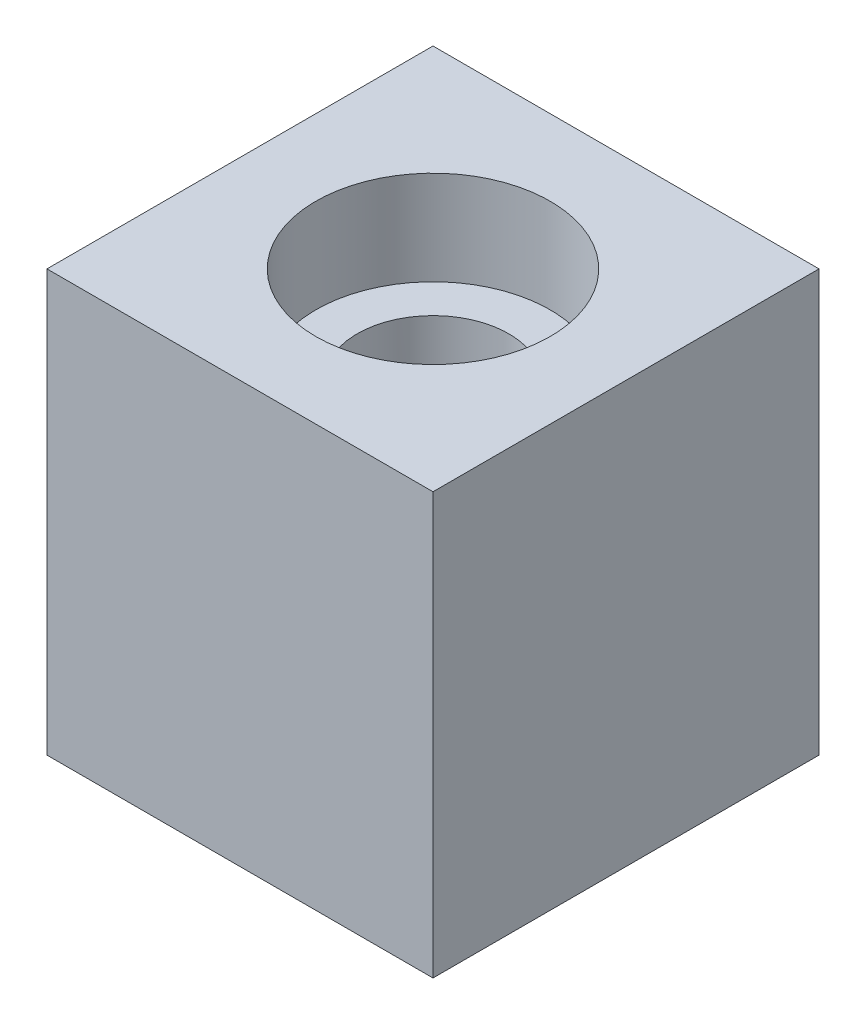
ISO-10303-21;
HEADER;
FILE_DESCRIPTION(('STEP AP214'),'2;1');
FILE_NAME('part.step','',(''),(''),'','','');
FILE_SCHEMA(('AUTOMOTIVE_DESIGN { 1 0 10303 214 1 1 1 1 }'));
ENDSEC;
DATA;
#1=APPLICATION_CONTEXT('core data for automotive mechanical design processes');
#2=APPLICATION_PROTOCOL_DEFINITION('international standard','automotive_design',2000,#1);
#3=PRODUCT_CONTEXT('',#1,'mechanical');
#4=PRODUCT('Part','Part','',(#3));
#5=PRODUCT_RELATED_PRODUCT_CATEGORY('part','',(#4));
#6=PRODUCT_DEFINITION_FORMATION('','',#4);
#7=PRODUCT_DEFINITION_CONTEXT('part definition',#1,'design');
#8=PRODUCT_DEFINITION('design','',#6,#7);
#9=PRODUCT_DEFINITION_SHAPE('','',#8);
#10=(LENGTH_UNIT() NAMED_UNIT(*) SI_UNIT(.MILLI.,.METRE.));
#11=(NAMED_UNIT(*) PLANE_ANGLE_UNIT() SI_UNIT($,.RADIAN.));
#12=(NAMED_UNIT(*) SI_UNIT($,.STERADIAN.) SOLID_ANGLE_UNIT());
#13=UNCERTAINTY_MEASURE_WITH_UNIT(LENGTH_MEASURE(1.E-05),#10,'distance_accuracy_value','');
#14=(GEOMETRIC_REPRESENTATION_CONTEXT(3) GLOBAL_UNCERTAINTY_ASSIGNED_CONTEXT((#13)) GLOBAL_UNIT_ASSIGNED_CONTEXT((#10,
#11,#12)) REPRESENTATION_CONTEXT('',''));
#15=CARTESIAN_POINT('',(0.,0.,0.));
#16=DIRECTION('',(0.,0.,1.));
#17=DIRECTION('',(1.,0.,0.));
#18=AXIS2_PLACEMENT_3D('',#15,#16,#17);
#19=CARTESIAN_POINT('',(34.9249999999999,0.,-34.925));
#20=DIRECTION('',(0.,0.999999999999999,0.));
#21=DIRECTION('',(0.,0.,0.999999999999997));
#22=AXIS2_PLACEMENT_3D('',#19,#20,#21);
#23=CYLINDRICAL_SURFACE('',#22,13.716);
#24=CARTESIAN_POINT('',(34.9249999999999,59.1820000000001,-34.925));
#25=DIRECTION('',(0.,0.999999999999999,0.));
#26=DIRECTION('',(0.,0.,0.999999999999997));
#27=AXIS2_PLACEMENT_3D('',#24,#25,#26);
#28=CIRCLE('',#27,13.716);
#29=CARTESIAN_POINT('',(34.9249999999999,59.1820000000001,-21.209));
#30=VERTEX_POINT('',#29);
#31=EDGE_CURVE('E120',#30,#30,#28,.F.);
#32=ORIENTED_EDGE('',*,*,#31,.F.);
#33=EDGE_LOOP('',(#32));
#34=FACE_BOUND('',#33,.T.);
#35=CARTESIAN_POINT('',(34.9249999999999,7.61999999999996,-34.925));
#36=DIRECTION('',(0.,-0.999999999999999,0.));
#37=DIRECTION('',(0.,0.,-0.999999999999997));
#38=AXIS2_PLACEMENT_3D('',#35,#36,#37);
#39=CIRCLE('',#38,13.716);
#40=CARTESIAN_POINT('',(34.9249999999999,7.61999999999996,-48.6409999999999));
#41=VERTEX_POINT('',#40);
#42=EDGE_CURVE('E54',#41,#41,#39,.F.);
#43=ORIENTED_EDGE('',*,*,#42,.F.);
#44=EDGE_LOOP('',(#43));
#45=FACE_BOUND('',#44,.T.);
#46=ADVANCED_FACE('F50',(#34,#45),#23,.F.);
#47=CARTESIAN_POINT('',(0.,76.2,0.));
#48=DIRECTION('',(0.999999999999996,0.,0.));
#49=DIRECTION('',(0.,0.,-0.999999999999997));
#50=AXIS2_PLACEMENT_3D('',#47,#48,#49);
#51=PLANE('',#50);
#52=DIRECTION('',(0.,0.,0.999999999999997));
#53=VECTOR('',#52,1.);
#54=CARTESIAN_POINT('',(0.,0.,0.));
#55=LINE('',#54,#53);
#56=CARTESIAN_POINT('',(0.,0.,-69.85));
#57=VERTEX_POINT('',#56);
#58=CARTESIAN_POINT('',(0.,0.,0.));
#59=VERTEX_POINT('',#58);
#60=EDGE_CURVE('E117',#57,#59,#55,.T.);
#61=ORIENTED_EDGE('',*,*,#60,.T.);
#62=DIRECTION('',(0.,-0.999999999999999,0.));
#63=VECTOR('',#62,1.);
#64=CARTESIAN_POINT('',(0.,76.2,0.));
#65=LINE('',#64,#63);
#66=CARTESIAN_POINT('',(0.,76.2,0.));
#67=VERTEX_POINT('',#66);
#68=EDGE_CURVE('E13',#67,#59,#65,.T.);
#69=ORIENTED_EDGE('',*,*,#68,.F.);
#70=DIRECTION('',(0.,0.,0.999999999999997));
#71=VECTOR('',#70,1.);
#72=CARTESIAN_POINT('',(0.,76.2,0.));
#73=LINE('',#72,#71);
#74=CARTESIAN_POINT('',(0.,76.2,-69.85));
#75=VERTEX_POINT('',#74);
#76=EDGE_CURVE('E104',#75,#67,#73,.T.);
#77=ORIENTED_EDGE('',*,*,#76,.F.);
#78=DIRECTION('',(0.,-0.999999999999999,0.));
#79=VECTOR('',#78,1.);
#80=CARTESIAN_POINT('',(0.,76.2,-69.85));
#81=LINE('',#80,#79);
#82=EDGE_CURVE('E113',#75,#57,#81,.T.);
#83=ORIENTED_EDGE('',*,*,#82,.T.);
#84=EDGE_LOOP('',(#61,#69,#77,#83));
#85=FACE_BOUND('',#84,.T.);
#86=ADVANCED_FACE('F52',(#85),#51,.F.);
#87=CARTESIAN_POINT('',(0.,76.2,0.));
#88=DIRECTION('',(0.,0.,-0.999999999999997));
#89=DIRECTION('',(-0.999999999999996,0.,0.));
#90=AXIS2_PLACEMENT_3D('',#87,#88,#89);
#91=PLANE('',#90);
#92=DIRECTION('',(0.999999999999996,0.,0.));
#93=VECTOR('',#92,1.);
#94=CARTESIAN_POINT('',(0.,0.,0.));
#95=LINE('',#94,#93);
#96=CARTESIAN_POINT('',(69.8500000000001,0.,0.));
#97=VERTEX_POINT('',#96);
#98=EDGE_CURVE('E108',#59,#97,#95,.T.);
#99=ORIENTED_EDGE('',*,*,#98,.T.);
#100=DIRECTION('',(0.,-0.999999999999999,0.));
#101=VECTOR('',#100,1.);
#102=CARTESIAN_POINT('',(69.8499999999996,76.2,0.));
#103=LINE('',#102,#101);
#104=CARTESIAN_POINT('',(69.8499999999996,76.2,0.));
#105=VERTEX_POINT('',#104);
#106=EDGE_CURVE('E60',#105,#97,#103,.T.);
#107=ORIENTED_EDGE('',*,*,#106,.F.);
#108=DIRECTION('',(0.999999999999996,0.,0.));
#109=VECTOR('',#108,1.);
#110=CARTESIAN_POINT('',(0.,76.2,0.));
#111=LINE('',#110,#109);
#112=EDGE_CURVE('E99',#67,#105,#111,.T.);
#113=ORIENTED_EDGE('',*,*,#112,.F.);
#114=ORIENTED_EDGE('',*,*,#68,.T.);
#115=EDGE_LOOP('',(#99,#107,#113,#114));
#116=FACE_BOUND('',#115,.T.);
#117=ADVANCED_FACE('F107',(#116),#91,.F.);
#118=CARTESIAN_POINT('',(69.8499999999996,76.2,0.));
#119=DIRECTION('',(-0.999999999999996,0.,0.));
#120=DIRECTION('',(0.,0.,0.999999999999997));
#121=AXIS2_PLACEMENT_3D('',#118,#119,#120);
#122=PLANE('',#121);
#123=DIRECTION('',(0.,0.,-0.999999999999997));
#124=VECTOR('',#123,1.);
#125=CARTESIAN_POINT('',(69.8500000000001,0.,0.));
#126=LINE('',#125,#124);
#127=CARTESIAN_POINT('',(69.8500000000001,0.,-69.85));
#128=VERTEX_POINT('',#127);
#129=EDGE_CURVE('E86',#97,#128,#126,.T.);
#130=ORIENTED_EDGE('',*,*,#129,.T.);
#131=DIRECTION('',(0.,-0.999999999999999,0.));
#132=VECTOR('',#131,1.);
#133=CARTESIAN_POINT('',(69.8499999999996,76.2,-69.85));
#134=LINE('',#133,#132);
#135=CARTESIAN_POINT('',(69.8499999999996,76.2,-69.85));
#136=VERTEX_POINT('',#135);
#137=EDGE_CURVE('E109',#136,#128,#134,.T.);
#138=ORIENTED_EDGE('',*,*,#137,.F.);
#139=DIRECTION('',(0.,0.,-0.999999999999997));
#140=VECTOR('',#139,1.);
#141=CARTESIAN_POINT('',(69.8499999999996,76.2,0.));
#142=LINE('',#141,#140);
#143=EDGE_CURVE('E102',#105,#136,#142,.T.);
#144=ORIENTED_EDGE('',*,*,#143,.F.);
#145=ORIENTED_EDGE('',*,*,#106,.T.);
#146=EDGE_LOOP('',(#130,#138,#144,#145));
#147=FACE_BOUND('',#146,.T.);
#148=ADVANCED_FACE('F111',(#147),#122,.F.);
#149=CARTESIAN_POINT('',(0.,76.2,-69.85));
#150=DIRECTION('',(0.,0.,0.999999999999997));
#151=DIRECTION('',(0.999999999999996,0.,0.));
#152=AXIS2_PLACEMENT_3D('',#149,#150,#151);
#153=PLANE('',#152);
#154=DIRECTION('',(-0.999999999999996,0.,0.));
#155=VECTOR('',#154,1.);
#156=CARTESIAN_POINT('',(0.,0.,-69.85));
#157=LINE('',#156,#155);
#158=EDGE_CURVE('E92',#128,#57,#157,.T.);
#159=ORIENTED_EDGE('',*,*,#158,.T.);
#160=ORIENTED_EDGE('',*,*,#82,.F.);
#161=DIRECTION('',(-0.999999999999996,0.,0.));
#162=VECTOR('',#161,1.);
#163=CARTESIAN_POINT('',(0.,76.2,-69.85));
#164=LINE('',#163,#162);
#165=EDGE_CURVE('E69',#136,#75,#164,.T.);
#166=ORIENTED_EDGE('',*,*,#165,.F.);
#167=ORIENTED_EDGE('',*,*,#137,.T.);
#168=EDGE_LOOP('',(#159,#160,#166,#167));
#169=FACE_BOUND('',#168,.T.);
#170=ADVANCED_FACE('F163',(#169),#153,.F.);
#171=CARTESIAN_POINT('',(0.,76.2,0.));
#172=DIRECTION('',(0.,-0.999999999999999,0.));
#173=DIRECTION('',(0.,0.,-0.999999999999997));
#174=AXIS2_PLACEMENT_3D('',#171,#172,#173);
#175=PLANE('',#174);
#176=CARTESIAN_POINT('',(34.9249999999999,76.2,-34.925));
#177=DIRECTION('',(0.,0.999999999999999,0.));
#178=DIRECTION('',(0.,0.,0.999999999999997));
#179=AXIS2_PLACEMENT_3D('',#176,#177,#178);
#180=CIRCLE('',#179,21.209);
#181=CARTESIAN_POINT('',(34.9249999999999,76.2,-13.716));
#182=VERTEX_POINT('',#181);
#183=EDGE_CURVE('E130',#182,#182,#180,.T.);
#184=ORIENTED_EDGE('',*,*,#183,.F.);
#185=EDGE_LOOP('',(#184));
#186=FACE_BOUND('',#185,.T.);
#187=ORIENTED_EDGE('',*,*,#76,.T.);
#188=ORIENTED_EDGE('',*,*,#112,.T.);
#189=ORIENTED_EDGE('',*,*,#143,.T.);
#190=ORIENTED_EDGE('',*,*,#165,.T.);
#191=EDGE_LOOP('',(#187,#188,#189,#190));
#192=FACE_BOUND('',#191,.T.);
#193=ADVANCED_FACE('F100',(#186,#192),#175,.F.);
#194=CARTESIAN_POINT('',(0.,0.,0.));
#195=DIRECTION('',(0.,-0.999999999999999,0.));
#196=DIRECTION('',(0.,0.,-0.999999999999997));
#197=AXIS2_PLACEMENT_3D('',#194,#195,#196);
#198=PLANE('',#197);
#199=CARTESIAN_POINT('',(34.9249999999999,0.,-34.925));
#200=DIRECTION('',(0.,-0.999999999999999,0.));
#201=DIRECTION('',(0.,0.,-0.999999999999997));
#202=AXIS2_PLACEMENT_3D('',#199,#200,#201);
#203=CIRCLE('',#202,21.209);
#204=CARTESIAN_POINT('',(34.9249999999999,0.,-56.1339999999999));
#205=VERTEX_POINT('',#204);
#206=EDGE_CURVE('E137',#205,#205,#203,.T.);
#207=ORIENTED_EDGE('',*,*,#206,.F.);
#208=EDGE_LOOP('',(#207));
#209=FACE_BOUND('',#208,.T.);
#210=ORIENTED_EDGE('',*,*,#60,.F.);
#211=ORIENTED_EDGE('',*,*,#158,.F.);
#212=ORIENTED_EDGE('',*,*,#129,.F.);
#213=ORIENTED_EDGE('',*,*,#98,.F.);
#214=EDGE_LOOP('',(#210,#211,#212,#213));
#215=FACE_BOUND('',#214,.T.);
#216=ADVANCED_FACE('F162',(#209,#215),#198,.T.);
#217=CARTESIAN_POINT('',(34.9249999999999,59.1820000000001,-34.925));
#218=DIRECTION('',(0.,0.999999999999999,0.));
#219=DIRECTION('',(0.,0.,0.999999999999997));
#220=AXIS2_PLACEMENT_3D('',#217,#218,#219);
#221=PLANE('',#220);
#222=CARTESIAN_POINT('',(34.9249999999999,59.1820000000001,-34.925));
#223=DIRECTION('',(0.,0.999999999999999,0.));
#224=DIRECTION('',(0.,0.,0.999999999999997));
#225=AXIS2_PLACEMENT_3D('',#222,#223,#224);
#226=CIRCLE('',#225,21.209);
#227=CARTESIAN_POINT('',(34.9249999999999,59.1820000000001,-13.716));
#228=VERTEX_POINT('',#227);
#229=EDGE_CURVE('E126',#228,#228,#226,.T.);
#230=ORIENTED_EDGE('',*,*,#229,.T.);
#231=EDGE_LOOP('',(#230));
#232=FACE_BOUND('',#231,.T.);
#233=ORIENTED_EDGE('',*,*,#31,.T.);
#234=EDGE_LOOP('',(#233));
#235=FACE_BOUND('',#234,.T.);
#236=ADVANCED_FACE('F167',(#232,#235),#221,.T.);
#237=CARTESIAN_POINT('',(34.9249999999999,59.1820000000001,-34.925));
#238=DIRECTION('',(0.,0.999999999999999,0.));
#239=DIRECTION('',(0.,0.,0.999999999999997));
#240=AXIS2_PLACEMENT_3D('',#237,#238,#239);
#241=CYLINDRICAL_SURFACE('',#240,21.209);
#242=ORIENTED_EDGE('',*,*,#229,.F.);
#243=EDGE_LOOP('',(#242));
#244=FACE_BOUND('',#243,.T.);
#245=ORIENTED_EDGE('',*,*,#183,.T.);
#246=EDGE_LOOP('',(#245));
#247=FACE_BOUND('',#246,.T.);
#248=ADVANCED_FACE('F158',(#244,#247),#241,.F.);
#249=CARTESIAN_POINT('',(34.9249999999999,7.61999999999996,-34.925));
#250=DIRECTION('',(0.,-0.999999999999999,0.));
#251=DIRECTION('',(0.,0.,-0.999999999999997));
#252=AXIS2_PLACEMENT_3D('',#249,#250,#251);
#253=PLANE('',#252);
#254=CARTESIAN_POINT('',(34.9249999999999,7.61999999999996,-34.925));
#255=DIRECTION('',(0.,-0.999999999999999,0.));
#256=DIRECTION('',(0.,0.,-0.999999999999997));
#257=AXIS2_PLACEMENT_3D('',#254,#255,#256);
#258=CIRCLE('',#257,21.209);
#259=CARTESIAN_POINT('',(34.9249999999999,7.61999999999996,-56.1339999999999));
#260=VERTEX_POINT('',#259);
#261=EDGE_CURVE('E140',#260,#260,#258,.T.);
#262=ORIENTED_EDGE('',*,*,#261,.T.);
#263=EDGE_LOOP('',(#262));
#264=FACE_BOUND('',#263,.T.);
#265=ORIENTED_EDGE('',*,*,#42,.T.);
#266=EDGE_LOOP('',(#265));
#267=FACE_BOUND('',#266,.T.);
#268=ADVANCED_FACE('F147',(#264,#267),#253,.T.);
#269=CARTESIAN_POINT('',(34.9249999999999,7.61999999999996,-34.925));
#270=DIRECTION('',(0.,-0.999999999999999,0.));
#271=DIRECTION('',(0.,0.,-0.999999999999997));
#272=AXIS2_PLACEMENT_3D('',#269,#270,#271);
#273=CYLINDRICAL_SURFACE('',#272,21.209);
#274=ORIENTED_EDGE('',*,*,#261,.F.);
#275=EDGE_LOOP('',(#274));
#276=FACE_BOUND('',#275,.T.);
#277=ORIENTED_EDGE('',*,*,#206,.T.);
#278=EDGE_LOOP('',(#277));
#279=FACE_BOUND('',#278,.T.);
#280=ADVANCED_FACE('F211',(#276,#279),#273,.F.);
#281=CLOSED_SHELL('',(#46,#86,#117,#148,#170,#193,#216,#236,#248,#268,#280));
#282=MANIFOLD_SOLID_BREP('B2',#281);
#283=ADVANCED_BREP_SHAPE_REPRESENTATION('',(#18,#282),#14);
#284=SHAPE_DEFINITION_REPRESENTATION(#9,#283);
ENDSEC;
END-ISO-10303-21;
